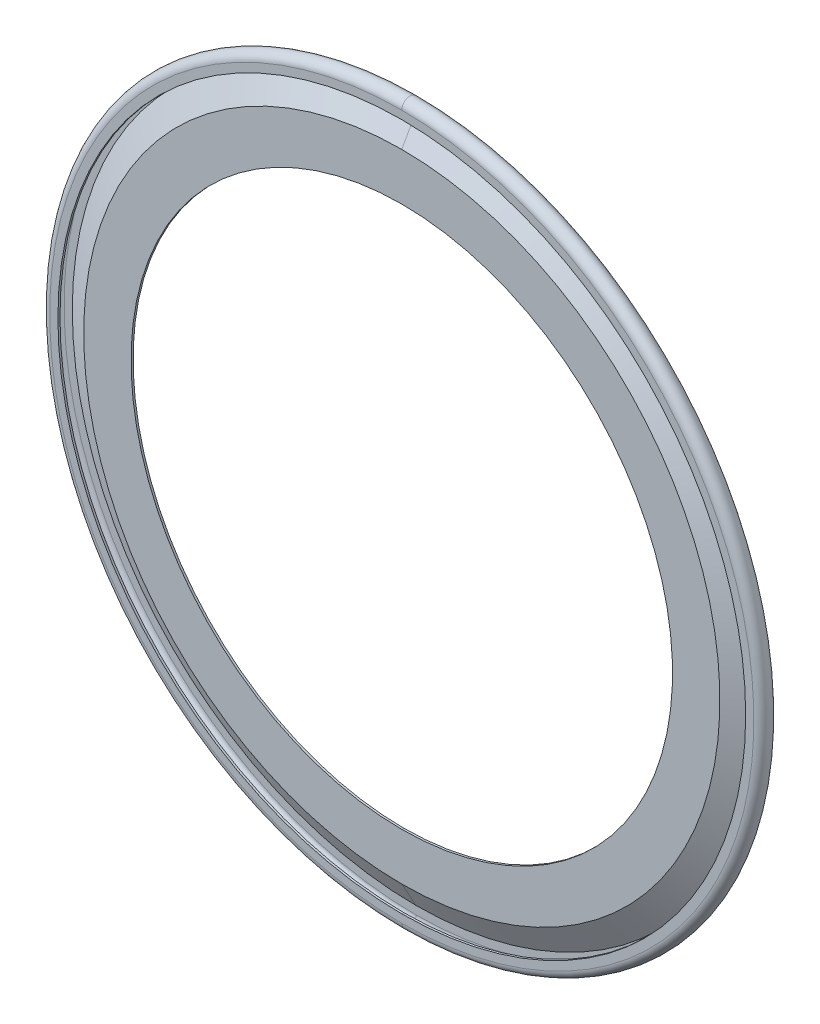
ISO-10303-21;
HEADER;
FILE_DESCRIPTION(('STEP AP214'),'2;1');
FILE_NAME('part.step','',(''),(''),'','','');
FILE_SCHEMA(('AUTOMOTIVE_DESIGN { 1 0 10303 214 1 1 1 1 }'));
ENDSEC;
DATA;
#1=APPLICATION_CONTEXT('core data for automotive mechanical design processes');
#2=APPLICATION_PROTOCOL_DEFINITION('international standard','automotive_design',2000,#1);
#3=PRODUCT_CONTEXT('',#1,'mechanical');
#4=PRODUCT('Part','Part','',(#3));
#5=PRODUCT_RELATED_PRODUCT_CATEGORY('part','',(#4));
#6=PRODUCT_DEFINITION_FORMATION('','',#4);
#7=PRODUCT_DEFINITION_CONTEXT('part definition',#1,'design');
#8=PRODUCT_DEFINITION('design','',#6,#7);
#9=PRODUCT_DEFINITION_SHAPE('','',#8);
#10=(LENGTH_UNIT() NAMED_UNIT(*) SI_UNIT(.MILLI.,.METRE.));
#11=(NAMED_UNIT(*) PLANE_ANGLE_UNIT() SI_UNIT($,.RADIAN.));
#12=(NAMED_UNIT(*) SI_UNIT($,.STERADIAN.) SOLID_ANGLE_UNIT());
#13=UNCERTAINTY_MEASURE_WITH_UNIT(LENGTH_MEASURE(1.E-05),#10,'distance_accuracy_value','');
#14=(GEOMETRIC_REPRESENTATION_CONTEXT(3) GLOBAL_UNCERTAINTY_ASSIGNED_CONTEXT((#13)) GLOBAL_UNIT_ASSIGNED_CONTEXT((#10,
#11,#12)) REPRESENTATION_CONTEXT('',''));
#15=CARTESIAN_POINT('',(0.,0.,0.));
#16=DIRECTION('',(0.,0.,1.));
#17=DIRECTION('',(1.,0.,0.));
#18=AXIS2_PLACEMENT_3D('',#15,#16,#17);
#19=CARTESIAN_POINT('',(0.,0.,1.34438262298618));
#20=DIRECTION('',(0.,0.,-1.));
#21=DIRECTION('',(0.,-1.,0.));
#22=AXIS2_PLACEMENT_3D('',#19,#20,#21);
#23=CONICAL_SURFACE('',#22,3.09170963241472,1.06270774153945);
#24=DIRECTION('',(0.,0.873676021976908,-0.486508179399489));
#25=VECTOR('',#24,1.);
#26=CARTESIAN_POINT('',(0.,3.10213003803638,1.33857999999999));
#27=LINE('',#26,#25);
#28=CARTESIAN_POINT('',(0.,3.10213003803638,1.33858));
#29=VERTEX_POINT('',#28);
#30=CARTESIAN_POINT('',(0.,3.35357479803638,1.1985625));
#31=VERTEX_POINT('',#30);
#32=EDGE_CURVE('E19',#29,#31,#27,.T.);
#33=ORIENTED_EDGE('',*,*,#32,.F.);
#34=CARTESIAN_POINT('',(0.,0.,1.33857999999999));
#35=DIRECTION('',(0.,0.,-1.));
#36=DIRECTION('',(0.,1.,0.));
#37=AXIS2_PLACEMENT_3D('',#34,#35,#36);
#38=CIRCLE('',#37,3.10213003803638);
#39=CARTESIAN_POINT('',(0.,-3.10213003803638,1.33858));
#40=VERTEX_POINT('',#39);
#41=EDGE_CURVE('E175',#29,#40,#38,.T.);
#42=ORIENTED_EDGE('',*,*,#41,.T.);
#43=DIRECTION('',(0.,-0.873676021976908,-0.486508179399489));
#44=VECTOR('',#43,1.);
#45=CARTESIAN_POINT('',(0.,-3.10213003803638,1.33857999999999));
#46=LINE('',#45,#44);
#47=CARTESIAN_POINT('',(0.,-3.35357479803638,1.1985625));
#48=VERTEX_POINT('',#47);
#49=EDGE_CURVE('E183',#40,#48,#46,.T.);
#50=ORIENTED_EDGE('',*,*,#49,.T.);
#51=CARTESIAN_POINT('',(0.,0.,1.1985625));
#52=DIRECTION('',(0.,0.,1.));
#53=DIRECTION('',(0.,-1.,0.));
#54=AXIS2_PLACEMENT_3D('',#51,#52,#53);
#55=CIRCLE('',#54,3.35357479803638);
#56=EDGE_CURVE('E190',#48,#31,#55,.T.);
#57=ORIENTED_EDGE('',*,*,#56,.T.);
#58=EDGE_LOOP('',(#33,#42,#50,#57));
#59=FACE_BOUND('',#58,.T.);
#60=ADVANCED_FACE('F16',(#59),#23,.T.);
#61=CARTESIAN_POINT('',(0.,0.,1.57353));
#62=DIRECTION('',(0.,0.,-1.));
#63=DIRECTION('',(0.,-1.,0.));
#64=AXIS2_PLACEMENT_3D('',#61,#62,#63);
#65=CYLINDRICAL_SURFACE('',#64,3.35357479803638);
#66=DIRECTION('',(0.,0.,1.));
#67=VECTOR('',#66,1.);
#68=CARTESIAN_POINT('',(0.,3.35357479803638,1.3185775));
#69=LINE('',#68,#67);
#70=CARTESIAN_POINT('',(0.,3.35357479803638,1.3185775));
#71=VERTEX_POINT('',#70);
#72=CARTESIAN_POINT('',(0.,3.35357479803638,1.33858));
#73=VERTEX_POINT('',#72);
#74=EDGE_CURVE('E24',#71,#73,#69,.T.);
#75=ORIENTED_EDGE('',*,*,#74,.T.);
#76=CARTESIAN_POINT('',(0.,0.,1.33858));
#77=DIRECTION('',(0.,0.,1.));
#78=DIRECTION('',(0.,1.,0.));
#79=AXIS2_PLACEMENT_3D('',#76,#77,#78);
#80=CIRCLE('',#79,3.35357479803638);
#81=CARTESIAN_POINT('',(0.,-3.35357479803638,1.33858));
#82=VERTEX_POINT('',#81);
#83=EDGE_CURVE('E134',#73,#82,#80,.T.);
#84=ORIENTED_EDGE('',*,*,#83,.T.);
#85=DIRECTION('',(0.,0.,-1.));
#86=VECTOR('',#85,1.);
#87=CARTESIAN_POINT('',(0.,-3.35357479803638,1.33858));
#88=LINE('',#87,#86);
#89=CARTESIAN_POINT('',(0.,-3.35357479803638,1.3185775));
#90=VERTEX_POINT('',#89);
#91=EDGE_CURVE('E11',#82,#90,#88,.T.);
#92=ORIENTED_EDGE('',*,*,#91,.T.);
#93=CARTESIAN_POINT('',(0.,0.,1.3185775));
#94=DIRECTION('',(0.,0.,-1.));
#95=DIRECTION('',(0.,-1.,0.));
#96=AXIS2_PLACEMENT_3D('',#93,#94,#95);
#97=CIRCLE('',#96,3.35357479803638);
#98=EDGE_CURVE('E213',#90,#71,#97,.T.);
#99=ORIENTED_EDGE('',*,*,#98,.T.);
#100=EDGE_LOOP('',(#75,#84,#92,#99));
#101=FACE_BOUND('',#100,.T.);
#102=ADVANCED_FACE('F217',(#101),#65,.F.);
#103=CARTESIAN_POINT('',(0.,0.,1.57353));
#104=DIRECTION('',(0.,0.,-1.));
#105=DIRECTION('',(0.,-1.,0.));
#106=AXIS2_PLACEMENT_3D('',#103,#104,#105);
#107=CYLINDRICAL_SURFACE('',#106,3.35357479803638);
#108=ORIENTED_EDGE('',*,*,#91,.F.);
#109=CARTESIAN_POINT('',(0.,0.,1.33858));
#110=DIRECTION('',(0.,0.,1.));
#111=DIRECTION('',(0.,-1.,0.));
#112=AXIS2_PLACEMENT_3D('',#109,#110,#111);
#113=CIRCLE('',#112,3.35357479803638);
#114=EDGE_CURVE('E121',#82,#73,#113,.T.);
#115=ORIENTED_EDGE('',*,*,#114,.T.);
#116=ORIENTED_EDGE('',*,*,#74,.F.);
#117=CARTESIAN_POINT('',(0.,0.,1.3185775));
#118=DIRECTION('',(0.,0.,-1.));
#119=DIRECTION('',(0.,1.,0.));
#120=AXIS2_PLACEMENT_3D('',#117,#118,#119);
#121=CIRCLE('',#120,3.35357479803638);
#122=EDGE_CURVE('E208',#71,#90,#121,.T.);
#123=ORIENTED_EDGE('',*,*,#122,.T.);
#124=EDGE_LOOP('',(#108,#115,#116,#123));
#125=FACE_BOUND('',#124,.T.);
#126=ADVANCED_FACE('F224',(#125),#107,.F.);
#127=CARTESIAN_POINT('',(0.,0.,1.3185775));
#128=DIRECTION('',(0.,0.,1.));
#129=DIRECTION('',(0.,1.,0.));
#130=AXIS2_PLACEMENT_3D('',#127,#128,#129);
#131=PLANE('',#130);
#132=ORIENTED_EDGE('',*,*,#98,.F.);
#133=ORIENTED_EDGE('',*,*,#122,.F.);
#134=EDGE_LOOP('',(#132,#133));
#135=FACE_BOUND('',#134,.T.);
#136=CARTESIAN_POINT('',(0.,0.,1.3185775));
#137=DIRECTION('',(0.,0.,1.));
#138=DIRECTION('',(0.,-1.,0.));
#139=AXIS2_PLACEMENT_3D('',#136,#137,#138);
#140=CIRCLE('',#139,3.43358479803638);
#141=CARTESIAN_POINT('',(0.,-3.43358479803638,1.3185775));
#142=VERTEX_POINT('',#141);
#143=CARTESIAN_POINT('',(0.,3.43358479803638,1.3185775));
#144=VERTEX_POINT('',#143);
#145=EDGE_CURVE('E198',#142,#144,#140,.T.);
#146=ORIENTED_EDGE('',*,*,#145,.F.);
#147=CARTESIAN_POINT('',(0.,0.,1.3185775));
#148=DIRECTION('',(0.,0.,1.));
#149=DIRECTION('',(0.,1.,0.));
#150=AXIS2_PLACEMENT_3D('',#147,#148,#149);
#151=CIRCLE('',#150,3.43358479803638);
#152=EDGE_CURVE('E200',#144,#142,#151,.T.);
#153=ORIENTED_EDGE('',*,*,#152,.F.);
#154=EDGE_LOOP('',(#146,#153));
#155=FACE_BOUND('',#154,.T.);
#156=ADVANCED_FACE('F273',(#135,#155),#131,.F.);
#157=CARTESIAN_POINT('',(0.,0.,1.25857));
#158=DIRECTION('',(0.,0.,1.));
#159=DIRECTION('',(0.,1.,0.));
#160=AXIS2_PLACEMENT_3D('',#157,#158,#159);
#161=TOROIDAL_SURFACE('',#160,3.43358479803638,0.0600075);
#162=ORIENTED_EDGE('',*,*,#152,.T.);
#163=CARTESIAN_POINT('',(0.,-3.43358479803638,1.25857));
#164=DIRECTION('',(1.,0.,0.));
#165=DIRECTION('',(0.,0.,1.));
#166=AXIS2_PLACEMENT_3D('',#163,#164,#165);
#167=CIRCLE('',#166,0.0600075);
#168=CARTESIAN_POINT('',(0.,-3.49359229803638,1.25857));
#169=VERTEX_POINT('',#168);
#170=EDGE_CURVE('E195',#142,#169,#167,.T.);
#171=ORIENTED_EDGE('',*,*,#170,.T.);
#172=CARTESIAN_POINT('',(0.,-3.43358479803638,1.25857));
#173=DIRECTION('',(1.,0.,0.));
#174=DIRECTION('',(0.,-1.,0.));
#175=AXIS2_PLACEMENT_3D('',#172,#173,#174);
#176=CIRCLE('',#175,0.0600075);
#177=CARTESIAN_POINT('',(0.,-3.43358479803638,1.1985625));
#178=VERTEX_POINT('',#177);
#179=EDGE_CURVE('E197',#169,#178,#176,.T.);
#180=ORIENTED_EDGE('',*,*,#179,.T.);
#181=CARTESIAN_POINT('',(0.,0.,1.1985625));
#182=DIRECTION('',(0.,0.,-1.));
#183=DIRECTION('',(0.,-1.,0.));
#184=AXIS2_PLACEMENT_3D('',#181,#182,#183);
#185=CIRCLE('',#184,3.43358479803638);
#186=CARTESIAN_POINT('',(0.,3.43358479803638,1.1985625));
#187=VERTEX_POINT('',#186);
#188=EDGE_CURVE('E188',#178,#187,#185,.T.);
#189=ORIENTED_EDGE('',*,*,#188,.T.);
#190=CARTESIAN_POINT('',(0.,3.43358479803638,1.25857));
#191=DIRECTION('',(-1.,0.,0.));
#192=DIRECTION('',(0.,1.,0.));
#193=AXIS2_PLACEMENT_3D('',#190,#191,#192);
#194=CIRCLE('',#193,0.0600075);
#195=CARTESIAN_POINT('',(0.,3.49359229803638,1.25857));
#196=VERTEX_POINT('',#195);
#197=EDGE_CURVE('E192',#196,#187,#194,.T.);
#198=ORIENTED_EDGE('',*,*,#197,.F.);
#199=CARTESIAN_POINT('',(0.,3.43358479803638,1.25857));
#200=DIRECTION('',(-1.,0.,0.));
#201=DIRECTION('',(0.,0.,1.));
#202=AXIS2_PLACEMENT_3D('',#199,#200,#201);
#203=CIRCLE('',#202,0.0600075);
#204=EDGE_CURVE('E201',#144,#196,#203,.T.);
#205=ORIENTED_EDGE('',*,*,#204,.F.);
#206=EDGE_LOOP('',(#162,#171,#180,#189,#198,#205));
#207=FACE_BOUND('',#206,.T.);
#208=ADVANCED_FACE('F269',(#207),#161,.F.);
#209=CARTESIAN_POINT('',(0.,0.,1.25857));
#210=DIRECTION('',(0.,0.,1.));
#211=DIRECTION('',(0.,1.,0.));
#212=AXIS2_PLACEMENT_3D('',#209,#210,#211);
#213=TOROIDAL_SURFACE('',#212,3.43358479803638,0.0600075);
#214=CARTESIAN_POINT('',(0.,0.,1.1985625));
#215=DIRECTION('',(0.,0.,-1.));
#216=DIRECTION('',(0.,1.,0.));
#217=AXIS2_PLACEMENT_3D('',#214,#215,#216);
#218=CIRCLE('',#217,3.43358479803638);
#219=EDGE_CURVE('E185',#187,#178,#218,.T.);
#220=ORIENTED_EDGE('',*,*,#219,.T.);
#221=ORIENTED_EDGE('',*,*,#179,.F.);
#222=ORIENTED_EDGE('',*,*,#170,.F.);
#223=ORIENTED_EDGE('',*,*,#145,.T.);
#224=ORIENTED_EDGE('',*,*,#204,.T.);
#225=ORIENTED_EDGE('',*,*,#197,.T.);
#226=EDGE_LOOP('',(#220,#221,#222,#223,#224,#225));
#227=FACE_BOUND('',#226,.T.);
#228=ADVANCED_FACE('F265',(#227),#213,.F.);
#229=CARTESIAN_POINT('',(0.,0.,1.1985625));
#230=DIRECTION('',(0.,0.,1.));
#231=DIRECTION('',(0.,1.,0.));
#232=AXIS2_PLACEMENT_3D('',#229,#230,#231);
#233=PLANE('',#232);
#234=CARTESIAN_POINT('',(0.,0.,1.1985625));
#235=DIRECTION('',(0.,0.,1.));
#236=DIRECTION('',(0.,1.,0.));
#237=AXIS2_PLACEMENT_3D('',#234,#235,#236);
#238=CIRCLE('',#237,3.35357479803638);
#239=EDGE_CURVE('E178',#31,#48,#238,.T.);
#240=ORIENTED_EDGE('',*,*,#239,.F.);
#241=ORIENTED_EDGE('',*,*,#56,.F.);
#242=EDGE_LOOP('',(#240,#241));
#243=FACE_BOUND('',#242,.T.);
#244=ORIENTED_EDGE('',*,*,#188,.F.);
#245=ORIENTED_EDGE('',*,*,#219,.F.);
#246=EDGE_LOOP('',(#244,#245));
#247=FACE_BOUND('',#246,.T.);
#248=ADVANCED_FACE('F259',(#243,#247),#233,.T.);
#249=CARTESIAN_POINT('',(0.,0.,1.34438262298618));
#250=DIRECTION('',(0.,0.,-1.));
#251=DIRECTION('',(0.,-1.,0.));
#252=AXIS2_PLACEMENT_3D('',#249,#250,#251);
#253=CONICAL_SURFACE('',#252,3.09170963241472,1.06270774153945);
#254=ORIENTED_EDGE('',*,*,#49,.F.);
#255=CARTESIAN_POINT('',(0.,0.,1.33857999999999));
#256=DIRECTION('',(0.,0.,-1.));
#257=DIRECTION('',(0.,-1.,0.));
#258=AXIS2_PLACEMENT_3D('',#255,#256,#257);
#259=CIRCLE('',#258,3.10213003803638);
#260=EDGE_CURVE('E172',#40,#29,#259,.T.);
#261=ORIENTED_EDGE('',*,*,#260,.T.);
#262=ORIENTED_EDGE('',*,*,#32,.T.);
#263=ORIENTED_EDGE('',*,*,#239,.T.);
#264=EDGE_LOOP('',(#254,#261,#262,#263));
#265=FACE_BOUND('',#264,.T.);
#266=ADVANCED_FACE('F245',(#265),#253,.T.);
#267=CARTESIAN_POINT('',(0.,0.,1.33858));
#268=DIRECTION('',(0.,0.,-1.));
#269=DIRECTION('',(0.,-1.,0.));
#270=AXIS2_PLACEMENT_3D('',#267,#268,#269);
#271=PLANE('',#270);
#272=CARTESIAN_POINT('',(0.,0.,1.33858));
#273=DIRECTION('',(0.,0.,1.));
#274=DIRECTION('',(0.,1.,0.));
#275=AXIS2_PLACEMENT_3D('',#272,#273,#274);
#276=CIRCLE('',#275,2.64033);
#277=CARTESIAN_POINT('',(0.,2.64033,1.33858));
#278=VERTEX_POINT('',#277);
#279=CARTESIAN_POINT('',(0.,-2.64033,1.33858));
#280=VERTEX_POINT('',#279);
#281=EDGE_CURVE('E169',#278,#280,#276,.T.);
#282=ORIENTED_EDGE('',*,*,#281,.F.);
#283=CARTESIAN_POINT('',(0.,0.,1.33858));
#284=DIRECTION('',(0.,0.,1.));
#285=DIRECTION('',(0.,-1.,0.));
#286=AXIS2_PLACEMENT_3D('',#283,#284,#285);
#287=CIRCLE('',#286,2.64033);
#288=EDGE_CURVE('E176',#280,#278,#287,.T.);
#289=ORIENTED_EDGE('',*,*,#288,.F.);
#290=EDGE_LOOP('',(#282,#289));
#291=FACE_BOUND('',#290,.T.);
#292=ORIENTED_EDGE('',*,*,#41,.F.);
#293=ORIENTED_EDGE('',*,*,#260,.F.);
#294=EDGE_LOOP('',(#292,#293));
#295=FACE_BOUND('',#294,.T.);
#296=ADVANCED_FACE('F247',(#291,#295),#271,.F.);
#297=CARTESIAN_POINT('',(0.,0.,1.346581));
#298=DIRECTION('',(0.,0.,-1.));
#299=DIRECTION('',(0.,-1.,0.));
#300=AXIS2_PLACEMENT_3D('',#297,#298,#299);
#301=CYLINDRICAL_SURFACE('',#300,2.64033);
#302=CARTESIAN_POINT('',(0.,0.,1.3185775));
#303=DIRECTION('',(0.,0.,-1.));
#304=DIRECTION('',(0.,1.,0.));
#305=AXIS2_PLACEMENT_3D('',#302,#303,#304);
#306=CIRCLE('',#305,2.64033);
#307=CARTESIAN_POINT('',(0.,2.64033,1.3185775));
#308=VERTEX_POINT('',#307);
#309=CARTESIAN_POINT('',(0.,-2.64033,1.3185775));
#310=VERTEX_POINT('',#309);
#311=EDGE_CURVE('E163',#308,#310,#306,.T.);
#312=ORIENTED_EDGE('',*,*,#311,.T.);
#313=DIRECTION('',(0.,0.,1.));
#314=VECTOR('',#313,1.);
#315=CARTESIAN_POINT('',(0.,-2.64033,1.3185775));
#316=LINE('',#315,#314);
#317=EDGE_CURVE('E166',#310,#280,#316,.T.);
#318=ORIENTED_EDGE('',*,*,#317,.T.);
#319=ORIENTED_EDGE('',*,*,#288,.T.);
#320=DIRECTION('',(0.,0.,1.));
#321=VECTOR('',#320,1.);
#322=CARTESIAN_POINT('',(0.,2.64033,1.3185775));
#323=LINE('',#322,#321);
#324=EDGE_CURVE('E165',#308,#278,#323,.T.);
#325=ORIENTED_EDGE('',*,*,#324,.F.);
#326=EDGE_LOOP('',(#312,#318,#319,#325));
#327=FACE_BOUND('',#326,.T.);
#328=ADVANCED_FACE('F249',(#327),#301,.F.);
#329=CARTESIAN_POINT('',(0.,0.,1.346581));
#330=DIRECTION('',(0.,0.,-1.));
#331=DIRECTION('',(0.,-1.,0.));
#332=AXIS2_PLACEMENT_3D('',#329,#330,#331);
#333=CYLINDRICAL_SURFACE('',#332,2.64033);
#334=ORIENTED_EDGE('',*,*,#281,.T.);
#335=ORIENTED_EDGE('',*,*,#317,.F.);
#336=CARTESIAN_POINT('',(0.,0.,1.3185775));
#337=DIRECTION('',(0.,0.,-1.));
#338=DIRECTION('',(0.,-1.,0.));
#339=AXIS2_PLACEMENT_3D('',#336,#337,#338);
#340=CIRCLE('',#339,2.64033);
#341=EDGE_CURVE('E160',#310,#308,#340,.T.);
#342=ORIENTED_EDGE('',*,*,#341,.T.);
#343=ORIENTED_EDGE('',*,*,#324,.T.);
#344=EDGE_LOOP('',(#334,#335,#342,#343));
#345=FACE_BOUND('',#344,.T.);
#346=ADVANCED_FACE('F256',(#345),#333,.F.);
#347=CARTESIAN_POINT('',(0.,0.,1.3185775));
#348=DIRECTION('',(0.,0.,-1.));
#349=DIRECTION('',(0.,-1.,0.));
#350=AXIS2_PLACEMENT_3D('',#347,#348,#349);
#351=PLANE('',#350);
#352=ORIENTED_EDGE('',*,*,#311,.F.);
#353=ORIENTED_EDGE('',*,*,#341,.F.);
#354=EDGE_LOOP('',(#352,#353));
#355=FACE_BOUND('',#354,.T.);
#356=CARTESIAN_POINT('',(0.,0.,1.31857749999999));
#357=DIRECTION('',(0.,0.,1.));
#358=DIRECTION('',(0.,1.,0.));
#359=AXIS2_PLACEMENT_3D('',#356,#357,#358);
#360=CIRCLE('',#359,3.10213003803638);
#361=CARTESIAN_POINT('',(0.,3.10213003803638,1.3185775));
#362=VERTEX_POINT('',#361);
#363=CARTESIAN_POINT('',(0.,-3.10213003803638,1.3185775));
#364=VERTEX_POINT('',#363);
#365=EDGE_CURVE('E155',#362,#364,#360,.T.);
#366=ORIENTED_EDGE('',*,*,#365,.F.);
#367=CARTESIAN_POINT('',(0.,0.,1.31857749999999));
#368=DIRECTION('',(0.,0.,1.));
#369=DIRECTION('',(0.,-1.,0.));
#370=AXIS2_PLACEMENT_3D('',#367,#368,#369);
#371=CIRCLE('',#370,3.10213003803638);
#372=EDGE_CURVE('E151',#364,#362,#371,.T.);
#373=ORIENTED_EDGE('',*,*,#372,.F.);
#374=EDGE_LOOP('',(#366,#373));
#375=FACE_BOUND('',#374,.T.);
#376=ADVANCED_FACE('F321',(#355,#375),#351,.T.);
#377=CARTESIAN_POINT('',(0.,0.,1.32438012298618));
#378=DIRECTION('',(0.,0.,-1.));
#379=DIRECTION('',(0.,-1.,0.));
#380=AXIS2_PLACEMENT_3D('',#377,#378,#379);
#381=CONICAL_SURFACE('',#380,3.09170963241472,1.06270774153945);
#382=ORIENTED_EDGE('',*,*,#365,.T.);
#383=DIRECTION('',(0.,0.873676021976908,0.486508179399489));
#384=VECTOR('',#383,1.);
#385=CARTESIAN_POINT('',(0.,-3.35357479803638,1.17856));
#386=LINE('',#385,#384);
#387=CARTESIAN_POINT('',(0.,-3.35357479803638,1.17856));
#388=VERTEX_POINT('',#387);
#389=EDGE_CURVE('E152',#388,#364,#386,.T.);
#390=ORIENTED_EDGE('',*,*,#389,.F.);
#391=CARTESIAN_POINT('',(0.,0.,1.17856));
#392=DIRECTION('',(0.,0.,-1.));
#393=DIRECTION('',(0.,-1.,0.));
#394=AXIS2_PLACEMENT_3D('',#391,#392,#393);
#395=CIRCLE('',#394,3.35357479803638);
#396=CARTESIAN_POINT('',(0.,3.35357479803638,1.17856));
#397=VERTEX_POINT('',#396);
#398=EDGE_CURVE('E146',#388,#397,#395,.T.);
#399=ORIENTED_EDGE('',*,*,#398,.T.);
#400=DIRECTION('',(0.,-0.873676021976908,0.486508179399489));
#401=VECTOR('',#400,1.);
#402=CARTESIAN_POINT('',(0.,3.35357479803638,1.17856));
#403=LINE('',#402,#401);
#404=EDGE_CURVE('E148',#397,#362,#403,.T.);
#405=ORIENTED_EDGE('',*,*,#404,.T.);
#406=EDGE_LOOP('',(#382,#390,#399,#405));
#407=FACE_BOUND('',#406,.T.);
#408=ADVANCED_FACE('F328',(#407),#381,.F.);
#409=CARTESIAN_POINT('',(0.,0.,1.32438012298618));
#410=DIRECTION('',(0.,0.,-1.));
#411=DIRECTION('',(0.,-1.,0.));
#412=AXIS2_PLACEMENT_3D('',#409,#410,#411);
#413=CONICAL_SURFACE('',#412,3.09170963241472,1.06270774153945);
#414=CARTESIAN_POINT('',(0.,0.,1.17856));
#415=DIRECTION('',(0.,0.,-1.));
#416=DIRECTION('',(0.,1.,0.));
#417=AXIS2_PLACEMENT_3D('',#414,#415,#416);
#418=CIRCLE('',#417,3.35357479803638);
#419=EDGE_CURVE('E142',#397,#388,#418,.T.);
#420=ORIENTED_EDGE('',*,*,#419,.T.);
#421=ORIENTED_EDGE('',*,*,#389,.T.);
#422=ORIENTED_EDGE('',*,*,#372,.T.);
#423=ORIENTED_EDGE('',*,*,#404,.F.);
#424=EDGE_LOOP('',(#420,#421,#422,#423));
#425=FACE_BOUND('',#424,.T.);
#426=ADVANCED_FACE('F336',(#425),#413,.F.);
#427=CARTESIAN_POINT('',(0.,0.,1.17856));
#428=DIRECTION('',(0.,0.,-1.));
#429=DIRECTION('',(0.,-1.,0.));
#430=AXIS2_PLACEMENT_3D('',#427,#428,#429);
#431=PLANE('',#430);
#432=ORIENTED_EDGE('',*,*,#398,.F.);
#433=ORIENTED_EDGE('',*,*,#419,.F.);
#434=EDGE_LOOP('',(#432,#433));
#435=FACE_BOUND('',#434,.T.);
#436=CARTESIAN_POINT('',(0.,0.,1.17856));
#437=DIRECTION('',(0.,0.,1.));
#438=DIRECTION('',(0.,1.,0.));
#439=AXIS2_PLACEMENT_3D('',#436,#437,#438);
#440=CIRCLE('',#439,3.43358479803638);
#441=CARTESIAN_POINT('',(0.,3.43358479803638,1.17856));
#442=VERTEX_POINT('',#441);
#443=CARTESIAN_POINT('',(0.,-3.43358479803638,1.17856));
#444=VERTEX_POINT('',#443);
#445=EDGE_CURVE('E137',#442,#444,#440,.T.);
#446=ORIENTED_EDGE('',*,*,#445,.F.);
#447=CARTESIAN_POINT('',(0.,0.,1.17856));
#448=DIRECTION('',(0.,0.,1.));
#449=DIRECTION('',(0.,-1.,0.));
#450=AXIS2_PLACEMENT_3D('',#447,#448,#449);
#451=CIRCLE('',#450,3.43358479803638);
#452=EDGE_CURVE('E140',#444,#442,#451,.T.);
#453=ORIENTED_EDGE('',*,*,#452,.F.);
#454=EDGE_LOOP('',(#446,#453));
#455=FACE_BOUND('',#454,.T.);
#456=ADVANCED_FACE('F344',(#435,#455),#431,.T.);
#457=CARTESIAN_POINT('',(0.,0.,1.25857));
#458=DIRECTION('',(0.,0.,-1.));
#459=DIRECTION('',(0.,-1.,0.));
#460=AXIS2_PLACEMENT_3D('',#457,#458,#459);
#461=TOROIDAL_SURFACE('',#460,3.43358479803638,0.08001);
#462=CARTESIAN_POINT('',(0.,0.,1.33858));
#463=DIRECTION('',(0.,0.,-1.));
#464=DIRECTION('',(0.,1.,0.));
#465=AXIS2_PLACEMENT_3D('',#462,#463,#464);
#466=CIRCLE('',#465,3.43358479803638);
#467=CARTESIAN_POINT('',(0.,3.43358479803638,1.33858));
#468=VERTEX_POINT('',#467);
#469=CARTESIAN_POINT('',(0.,-3.43358479803638,1.33858));
#470=VERTEX_POINT('',#469);
#471=EDGE_CURVE('E115',#468,#470,#466,.T.);
#472=ORIENTED_EDGE('',*,*,#471,.T.);
#473=CARTESIAN_POINT('',(0.,-3.43358479803638,1.25857));
#474=DIRECTION('',(1.,0.,0.));
#475=DIRECTION('',(0.,0.,1.));
#476=AXIS2_PLACEMENT_3D('',#473,#474,#475);
#477=CIRCLE('',#476,0.08001);
#478=CARTESIAN_POINT('',(0.,-3.51359479803638,1.25857));
#479=VERTEX_POINT('',#478);
#480=EDGE_CURVE('E31',#470,#479,#477,.T.);
#481=ORIENTED_EDGE('',*,*,#480,.T.);
#482=CARTESIAN_POINT('',(0.,-3.43358479803638,1.25857));
#483=DIRECTION('',(1.,0.,0.));
#484=DIRECTION('',(0.,-1.,0.));
#485=AXIS2_PLACEMENT_3D('',#482,#483,#484);
#486=CIRCLE('',#485,0.08001);
#487=EDGE_CURVE('E127',#479,#444,#486,.T.);
#488=ORIENTED_EDGE('',*,*,#487,.T.);
#489=ORIENTED_EDGE('',*,*,#452,.T.);
#490=CARTESIAN_POINT('',(0.,3.43358479803638,1.25857));
#491=DIRECTION('',(-1.,0.,0.));
#492=DIRECTION('',(0.,1.,0.));
#493=AXIS2_PLACEMENT_3D('',#490,#491,#492);
#494=CIRCLE('',#493,0.08001);
#495=CARTESIAN_POINT('',(0.,3.51359479803638,1.25857));
#496=VERTEX_POINT('',#495);
#497=EDGE_CURVE('E38',#496,#442,#494,.T.);
#498=ORIENTED_EDGE('',*,*,#497,.F.);
#499=CARTESIAN_POINT('',(0.,3.43358479803638,1.25857));
#500=DIRECTION('',(-1.,0.,0.));
#501=DIRECTION('',(0.,0.,1.));
#502=AXIS2_PLACEMENT_3D('',#499,#500,#501);
#503=CIRCLE('',#502,0.08001);
#504=EDGE_CURVE('E117',#468,#496,#503,.T.);
#505=ORIENTED_EDGE('',*,*,#504,.F.);
#506=EDGE_LOOP('',(#472,#481,#488,#489,#498,#505));
#507=FACE_BOUND('',#506,.T.);
#508=ADVANCED_FACE('F116',(#507),#461,.T.);
#509=CARTESIAN_POINT('',(0.,0.,1.25857));
#510=DIRECTION('',(0.,0.,-1.));
#511=DIRECTION('',(0.,-1.,0.));
#512=AXIS2_PLACEMENT_3D('',#509,#510,#511);
#513=TOROIDAL_SURFACE('',#512,3.43358479803638,0.08001);
#514=ORIENTED_EDGE('',*,*,#445,.T.);
#515=ORIENTED_EDGE('',*,*,#487,.F.);
#516=ORIENTED_EDGE('',*,*,#480,.F.);
#517=CARTESIAN_POINT('',(0.,0.,1.33858));
#518=DIRECTION('',(0.,0.,-1.));
#519=DIRECTION('',(0.,-1.,0.));
#520=AXIS2_PLACEMENT_3D('',#517,#518,#519);
#521=CIRCLE('',#520,3.43358479803638);
#522=EDGE_CURVE('E122',#470,#468,#521,.T.);
#523=ORIENTED_EDGE('',*,*,#522,.T.);
#524=ORIENTED_EDGE('',*,*,#504,.T.);
#525=ORIENTED_EDGE('',*,*,#497,.T.);
#526=EDGE_LOOP('',(#514,#515,#516,#523,#524,#525));
#527=FACE_BOUND('',#526,.T.);
#528=ADVANCED_FACE('F126',(#527),#513,.T.);
#529=CARTESIAN_POINT('',(0.,0.,1.33858));
#530=DIRECTION('',(0.,0.,-1.));
#531=DIRECTION('',(0.,-1.,0.));
#532=AXIS2_PLACEMENT_3D('',#529,#530,#531);
#533=PLANE('',#532);
#534=ORIENTED_EDGE('',*,*,#83,.F.);
#535=ORIENTED_EDGE('',*,*,#114,.F.);
#536=EDGE_LOOP('',(#534,#535));
#537=FACE_BOUND('',#536,.T.);
#538=ORIENTED_EDGE('',*,*,#471,.F.);
#539=ORIENTED_EDGE('',*,*,#522,.F.);
#540=EDGE_LOOP('',(#538,#539));
#541=FACE_BOUND('',#540,.T.);
#542=ADVANCED_FACE('F129',(#537,#541),#533,.F.);
#543=CLOSED_SHELL('',(#60,#102,#126,#156,#208,#228,#248,#266,#296,#328,#346,#376,#408,#426,#456,
#508,#528,#542));
#544=MANIFOLD_SOLID_BREP('B1',#543);
#545=ADVANCED_BREP_SHAPE_REPRESENTATION('',(#18,#544),#14);
#546=SHAPE_DEFINITION_REPRESENTATION(#9,#545);
ENDSEC;
END-ISO-10303-21;
